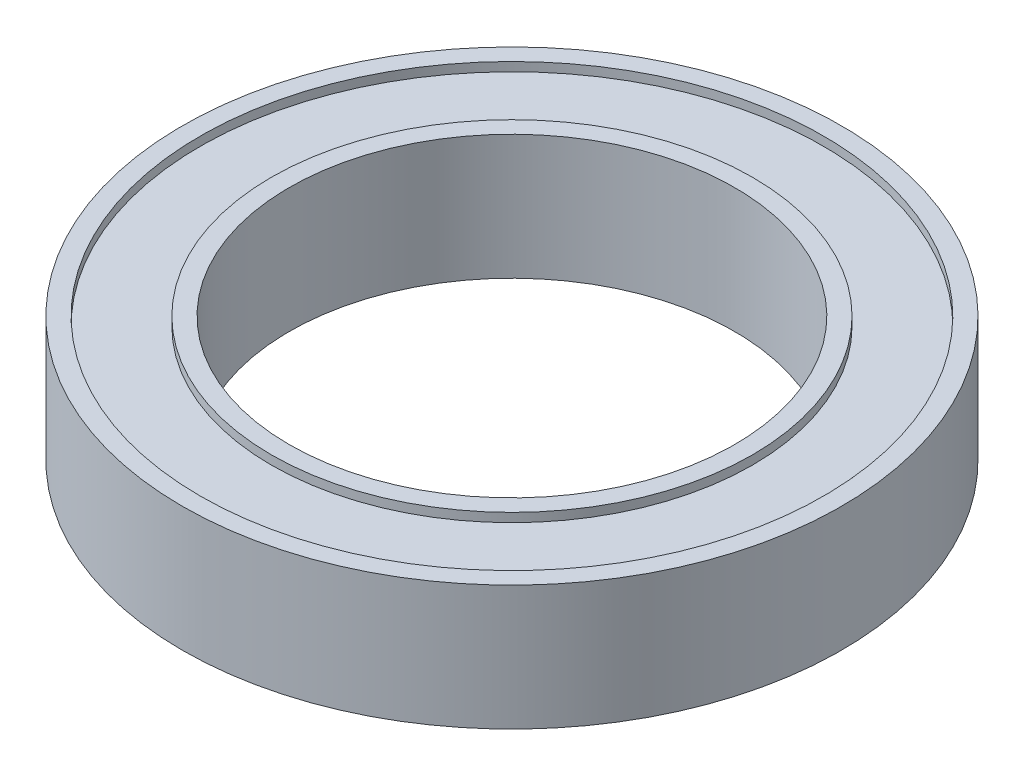
ISO-10303-21;
HEADER;
FILE_DESCRIPTION(('STEP AP214'),'2;1');
FILE_NAME('part.step','',(''),(''),'','','');
FILE_SCHEMA(('AUTOMOTIVE_DESIGN { 1 0 10303 214 1 1 1 1 }'));
ENDSEC;
DATA;
#1=APPLICATION_CONTEXT('core data for automotive mechanical design processes');
#2=APPLICATION_PROTOCOL_DEFINITION('international standard','automotive_design',2000,#1);
#3=PRODUCT_CONTEXT('',#1,'mechanical');
#4=PRODUCT('Part','Part','',(#3));
#5=PRODUCT_RELATED_PRODUCT_CATEGORY('part','',(#4));
#6=PRODUCT_DEFINITION_FORMATION('','',#4);
#7=PRODUCT_DEFINITION_CONTEXT('part definition',#1,'design');
#8=PRODUCT_DEFINITION('design','',#6,#7);
#9=PRODUCT_DEFINITION_SHAPE('','',#8);
#10=(LENGTH_UNIT() NAMED_UNIT(*) SI_UNIT(.MILLI.,.METRE.));
#11=(NAMED_UNIT(*) PLANE_ANGLE_UNIT() SI_UNIT($,.RADIAN.));
#12=(NAMED_UNIT(*) SI_UNIT($,.STERADIAN.) SOLID_ANGLE_UNIT());
#13=UNCERTAINTY_MEASURE_WITH_UNIT(LENGTH_MEASURE(1.E-05),#10,'distance_accuracy_value','');
#14=(GEOMETRIC_REPRESENTATION_CONTEXT(3) GLOBAL_UNCERTAINTY_ASSIGNED_CONTEXT((#13)) GLOBAL_UNIT_ASSIGNED_CONTEXT((#10,
#11,#12)) REPRESENTATION_CONTEXT('',''));
#15=CARTESIAN_POINT('',(0.,0.,0.));
#16=DIRECTION('',(0.,0.,1.));
#17=DIRECTION('',(1.,0.,0.));
#18=AXIS2_PLACEMENT_3D('',#15,#16,#17);
#19=CARTESIAN_POINT('',(0.,-3.5,0.));
#20=DIRECTION('',(0.,1.,0.));
#21=DIRECTION('',(0.,0.,1.));
#22=AXIS2_PLACEMENT_3D('',#19,#20,#21);
#23=CYLINDRICAL_SURFACE('',#22,17.5);
#24=CARTESIAN_POINT('',(0.,-3.5,0.));
#25=DIRECTION('',(0.,1.,0.));
#26=DIRECTION('',(0.,0.,1.));
#27=AXIS2_PLACEMENT_3D('',#24,#25,#26);
#28=CIRCLE('',#27,17.5);
#29=CARTESIAN_POINT('',(0.,-3.5,17.5));
#30=VERTEX_POINT('',#29);
#31=EDGE_CURVE('E64',#30,#30,#28,.T.);
#32=ORIENTED_EDGE('',*,*,#31,.F.);
#33=EDGE_LOOP('',(#32));
#34=FACE_BOUND('',#33,.T.);
#35=CARTESIAN_POINT('',(0.,-3.,0.));
#36=DIRECTION('',(0.,1.,0.));
#37=DIRECTION('',(0.,0.,1.));
#38=AXIS2_PLACEMENT_3D('',#35,#36,#37);
#39=CIRCLE('',#38,17.5);
#40=CARTESIAN_POINT('',(0.,-3.,17.5));
#41=VERTEX_POINT('',#40);
#42=EDGE_CURVE('E11',#41,#41,#39,.F.);
#43=ORIENTED_EDGE('',*,*,#42,.F.);
#44=EDGE_LOOP('',(#43));
#45=FACE_BOUND('',#44,.T.);
#46=ADVANCED_FACE('F53',(#34,#45),#23,.F.);
#47=CARTESIAN_POINT('',(0.,3.,0.));
#48=DIRECTION('',(0.,1.,0.));
#49=DIRECTION('',(0.,0.,1.));
#50=AXIS2_PLACEMENT_3D('',#47,#48,#49);
#51=CIRCLE('',#50,17.5);
#52=CARTESIAN_POINT('',(0.,3.,17.5));
#53=VERTEX_POINT('',#52);
#54=EDGE_CURVE('E76',#53,#53,#51,.T.);
#55=ORIENTED_EDGE('',*,*,#54,.F.);
#56=EDGE_LOOP('',(#55));
#57=FACE_BOUND('',#56,.T.);
#58=CARTESIAN_POINT('',(0.,3.5,0.));
#59=DIRECTION('',(0.,1.,0.));
#60=DIRECTION('',(0.,0.,1.));
#61=AXIS2_PLACEMENT_3D('',#58,#59,#60);
#62=CIRCLE('',#61,17.5);
#63=CARTESIAN_POINT('',(0.,3.5,17.5));
#64=VERTEX_POINT('',#63);
#65=EDGE_CURVE('E73',#64,#64,#62,.T.);
#66=ORIENTED_EDGE('',*,*,#65,.T.);
#67=EDGE_LOOP('',(#66));
#68=FACE_BOUND('',#67,.T.);
#69=ADVANCED_FACE('F55',(#57,#68),#23,.F.);
#70=CARTESIAN_POINT('',(0.,-3.5,0.));
#71=DIRECTION('',(0.,1.,0.));
#72=DIRECTION('',(0.,0.,1.));
#73=AXIS2_PLACEMENT_3D('',#70,#71,#72);
#74=CYLINDRICAL_SURFACE('',#73,18.5);
#75=CARTESIAN_POINT('',(0.,-3.5,0.));
#76=DIRECTION('',(0.,1.,0.));
#77=DIRECTION('',(0.,0.,1.));
#78=AXIS2_PLACEMENT_3D('',#75,#76,#77);
#79=CIRCLE('',#78,18.5);
#80=CARTESIAN_POINT('',(0.,-3.5,18.5));
#81=VERTEX_POINT('',#80);
#82=EDGE_CURVE('E60',#81,#81,#79,.T.);
#83=ORIENTED_EDGE('',*,*,#82,.T.);
#84=EDGE_LOOP('',(#83));
#85=FACE_BOUND('',#84,.T.);
#86=CARTESIAN_POINT('',(0.,3.5,0.));
#87=DIRECTION('',(0.,1.,0.));
#88=DIRECTION('',(0.,0.,1.));
#89=AXIS2_PLACEMENT_3D('',#86,#87,#88);
#90=CIRCLE('',#89,18.5);
#91=CARTESIAN_POINT('',(0.,3.5,18.5));
#92=VERTEX_POINT('',#91);
#93=EDGE_CURVE('E68',#92,#92,#90,.T.);
#94=ORIENTED_EDGE('',*,*,#93,.F.);
#95=EDGE_LOOP('',(#94));
#96=FACE_BOUND('',#95,.T.);
#97=ADVANCED_FACE('F128',(#85,#96),#74,.T.);
#98=CARTESIAN_POINT('',(0.,-3.5,0.));
#99=DIRECTION('',(0.,1.,0.));
#100=DIRECTION('',(0.,0.,1.));
#101=AXIS2_PLACEMENT_3D('',#98,#99,#100);
#102=PLANE('',#101);
#103=ORIENTED_EDGE('',*,*,#31,.T.);
#104=EDGE_LOOP('',(#103));
#105=FACE_BOUND('',#104,.T.);
#106=ORIENTED_EDGE('',*,*,#82,.F.);
#107=EDGE_LOOP('',(#106));
#108=FACE_BOUND('',#107,.T.);
#109=ADVANCED_FACE('F133',(#105,#108),#102,.F.);
#110=CARTESIAN_POINT('',(0.,3.5,0.));
#111=DIRECTION('',(0.,1.,0.));
#112=DIRECTION('',(0.,0.,1.));
#113=AXIS2_PLACEMENT_3D('',#110,#111,#112);
#114=PLANE('',#113);
#115=ORIENTED_EDGE('',*,*,#65,.F.);
#116=EDGE_LOOP('',(#115));
#117=FACE_BOUND('',#116,.T.);
#118=ORIENTED_EDGE('',*,*,#93,.T.);
#119=EDGE_LOOP('',(#118));
#120=FACE_BOUND('',#119,.T.);
#121=ADVANCED_FACE('F136',(#117,#120),#114,.T.);
#122=CARTESIAN_POINT('',(0.,-3.,0.));
#123=DIRECTION('',(0.,1.,0.));
#124=DIRECTION('',(0.,0.,1.));
#125=AXIS2_PLACEMENT_3D('',#122,#123,#124);
#126=PLANE('',#125);
#127=CARTESIAN_POINT('',(0.,-3.,0.));
#128=DIRECTION('',(0.,1.,0.));
#129=DIRECTION('',(0.,0.,1.));
#130=AXIS2_PLACEMENT_3D('',#127,#128,#129);
#131=CIRCLE('',#130,13.5);
#132=CARTESIAN_POINT('',(0.,-3.,13.5));
#133=VERTEX_POINT('',#132);
#134=EDGE_CURVE('E82',#133,#133,#131,.T.);
#135=ORIENTED_EDGE('',*,*,#134,.T.);
#136=EDGE_LOOP('',(#135));
#137=FACE_BOUND('',#136,.T.);
#138=ORIENTED_EDGE('',*,*,#42,.T.);
#139=EDGE_LOOP('',(#138));
#140=FACE_BOUND('',#139,.T.);
#141=ADVANCED_FACE('F142',(#137,#140),#126,.F.);
#142=CARTESIAN_POINT('',(0.,3.,0.));
#143=DIRECTION('',(0.,1.,0.));
#144=DIRECTION('',(0.,0.,1.));
#145=AXIS2_PLACEMENT_3D('',#142,#143,#144);
#146=PLANE('',#145);
#147=ORIENTED_EDGE('',*,*,#54,.T.);
#148=EDGE_LOOP('',(#147));
#149=FACE_BOUND('',#148,.T.);
#150=CARTESIAN_POINT('',(0.,3.,0.));
#151=DIRECTION('',(0.,1.,0.));
#152=DIRECTION('',(0.,0.,1.));
#153=AXIS2_PLACEMENT_3D('',#150,#151,#152);
#154=CIRCLE('',#153,13.5);
#155=CARTESIAN_POINT('',(0.,3.,13.5));
#156=VERTEX_POINT('',#155);
#157=EDGE_CURVE('E79',#156,#156,#154,.T.);
#158=ORIENTED_EDGE('',*,*,#157,.F.);
#159=EDGE_LOOP('',(#158));
#160=FACE_BOUND('',#159,.T.);
#161=ADVANCED_FACE('F121',(#149,#160),#146,.T.);
#162=CARTESIAN_POINT('',(0.,-3.5,0.));
#163=DIRECTION('',(0.,1.,0.));
#164=DIRECTION('',(0.,0.,1.));
#165=AXIS2_PLACEMENT_3D('',#162,#163,#164);
#166=CYLINDRICAL_SURFACE('',#165,13.5);
#167=CARTESIAN_POINT('',(0.,-3.5,0.));
#168=DIRECTION('',(0.,1.,0.));
#169=DIRECTION('',(0.,0.,1.));
#170=AXIS2_PLACEMENT_3D('',#167,#168,#169);
#171=CIRCLE('',#170,13.5);
#172=CARTESIAN_POINT('',(0.,-3.5,13.5));
#173=VERTEX_POINT('',#172);
#174=EDGE_CURVE('E85',#173,#173,#171,.T.);
#175=ORIENTED_EDGE('',*,*,#174,.T.);
#176=EDGE_LOOP('',(#175));
#177=FACE_BOUND('',#176,.T.);
#178=ORIENTED_EDGE('',*,*,#134,.F.);
#179=EDGE_LOOP('',(#178));
#180=FACE_BOUND('',#179,.T.);
#181=ADVANCED_FACE('F111',(#177,#180),#166,.T.);
#182=CARTESIAN_POINT('',(0.,-3.5,0.));
#183=DIRECTION('',(0.,1.,0.));
#184=DIRECTION('',(0.,0.,1.));
#185=AXIS2_PLACEMENT_3D('',#182,#183,#184);
#186=CYLINDRICAL_SURFACE('',#185,12.5);
#187=CARTESIAN_POINT('',(0.,-3.5,0.));
#188=DIRECTION('',(0.,1.,0.));
#189=DIRECTION('',(0.,0.,1.));
#190=AXIS2_PLACEMENT_3D('',#187,#188,#189);
#191=CIRCLE('',#190,12.5);
#192=CARTESIAN_POINT('',(0.,-3.5,12.5));
#193=VERTEX_POINT('',#192);
#194=EDGE_CURVE('E88',#193,#193,#191,.T.);
#195=ORIENTED_EDGE('',*,*,#194,.F.);
#196=EDGE_LOOP('',(#195));
#197=FACE_BOUND('',#196,.T.);
#198=CARTESIAN_POINT('',(0.,3.5,0.));
#199=DIRECTION('',(0.,1.,0.));
#200=DIRECTION('',(0.,0.,1.));
#201=AXIS2_PLACEMENT_3D('',#198,#199,#200);
#202=CIRCLE('',#201,12.5);
#203=CARTESIAN_POINT('',(0.,3.5,12.5));
#204=VERTEX_POINT('',#203);
#205=EDGE_CURVE('E94',#204,#204,#202,.T.);
#206=ORIENTED_EDGE('',*,*,#205,.T.);
#207=EDGE_LOOP('',(#206));
#208=FACE_BOUND('',#207,.T.);
#209=ADVANCED_FACE('F98',(#197,#208),#186,.F.);
#210=ORIENTED_EDGE('',*,*,#157,.T.);
#211=EDGE_LOOP('',(#210));
#212=FACE_BOUND('',#211,.T.);
#213=CARTESIAN_POINT('',(0.,3.5,0.));
#214=DIRECTION('',(0.,1.,0.));
#215=DIRECTION('',(0.,0.,1.));
#216=AXIS2_PLACEMENT_3D('',#213,#214,#215);
#217=CIRCLE('',#216,13.5);
#218=CARTESIAN_POINT('',(0.,3.5,13.5));
#219=VERTEX_POINT('',#218);
#220=EDGE_CURVE('E91',#219,#219,#217,.T.);
#221=ORIENTED_EDGE('',*,*,#220,.F.);
#222=EDGE_LOOP('',(#221));
#223=FACE_BOUND('',#222,.T.);
#224=ADVANCED_FACE('F107',(#212,#223),#166,.T.);
#225=CARTESIAN_POINT('',(0.,-3.5,0.));
#226=DIRECTION('',(0.,1.,0.));
#227=DIRECTION('',(0.,0.,1.));
#228=AXIS2_PLACEMENT_3D('',#225,#226,#227);
#229=PLANE('',#228);
#230=ORIENTED_EDGE('',*,*,#194,.T.);
#231=EDGE_LOOP('',(#230));
#232=FACE_BOUND('',#231,.T.);
#233=ORIENTED_EDGE('',*,*,#174,.F.);
#234=EDGE_LOOP('',(#233));
#235=FACE_BOUND('',#234,.T.);
#236=ADVANCED_FACE('F103',(#232,#235),#229,.F.);
#237=CARTESIAN_POINT('',(0.,3.5,0.));
#238=DIRECTION('',(0.,1.,0.));
#239=DIRECTION('',(0.,0.,1.));
#240=AXIS2_PLACEMENT_3D('',#237,#238,#239);
#241=PLANE('',#240);
#242=ORIENTED_EDGE('',*,*,#205,.F.);
#243=EDGE_LOOP('',(#242));
#244=FACE_BOUND('',#243,.T.);
#245=ORIENTED_EDGE('',*,*,#220,.T.);
#246=EDGE_LOOP('',(#245));
#247=FACE_BOUND('',#246,.T.);
#248=ADVANCED_FACE('F100',(#244,#247),#241,.T.);
#249=CLOSED_SHELL('',(#46,#69,#97,#109,#121,#141,#161,#181,#209,#224,#236,#248));
#250=MANIFOLD_SOLID_BREP('B2',#249);
#251=ADVANCED_BREP_SHAPE_REPRESENTATION('',(#18,#250),#14);
#252=SHAPE_DEFINITION_REPRESENTATION(#9,#251);
ENDSEC;
END-ISO-10303-21;
